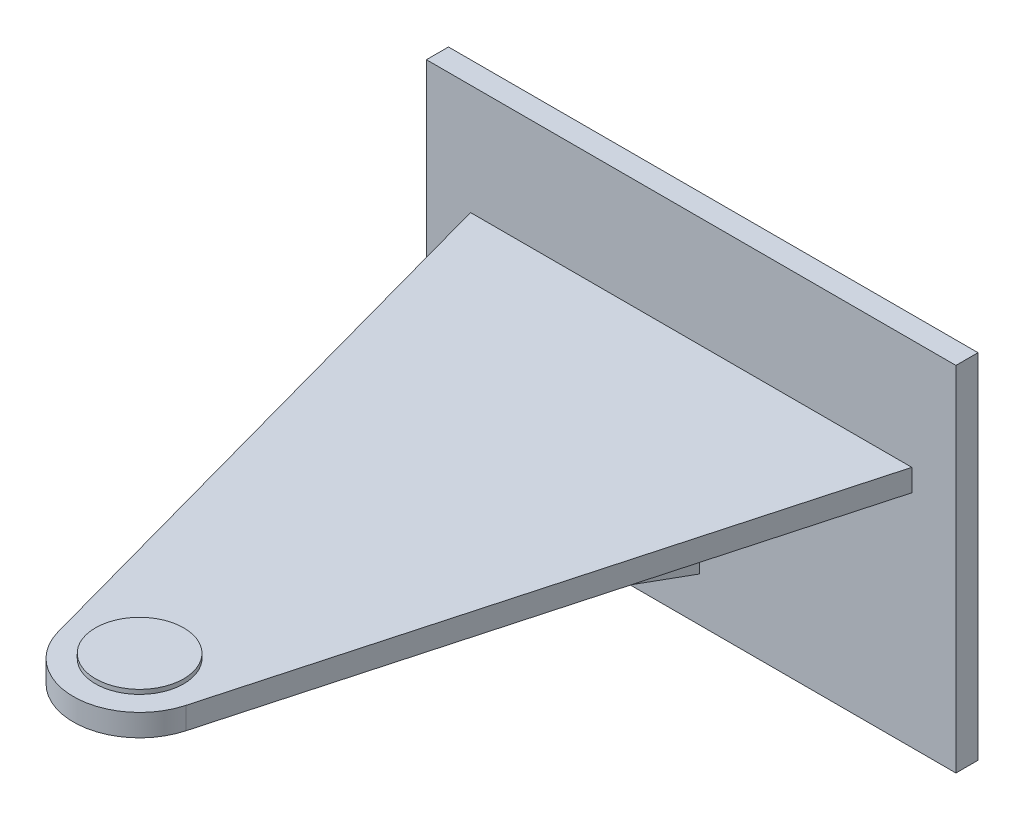
ISO-10303-21;
HEADER;
FILE_DESCRIPTION(('STEP AP214'),'2;1');
FILE_NAME('part.step','',(''),(''),'','','');
FILE_SCHEMA(('AUTOMOTIVE_DESIGN { 1 0 10303 214 1 1 1 1 }'));
ENDSEC;
DATA;
#1=APPLICATION_CONTEXT('core data for automotive mechanical design processes');
#2=APPLICATION_PROTOCOL_DEFINITION('international standard','automotive_design',2000,#1);
#3=PRODUCT_CONTEXT('',#1,'mechanical');
#4=PRODUCT('Part','Part','',(#3));
#5=PRODUCT_RELATED_PRODUCT_CATEGORY('part','',(#4));
#6=PRODUCT_DEFINITION_FORMATION('','',#4);
#7=PRODUCT_DEFINITION_CONTEXT('part definition',#1,'design');
#8=PRODUCT_DEFINITION('design','',#6,#7);
#9=PRODUCT_DEFINITION_SHAPE('','',#8);
#10=(LENGTH_UNIT() NAMED_UNIT(*) SI_UNIT(.MILLI.,.METRE.));
#11=(NAMED_UNIT(*) PLANE_ANGLE_UNIT() SI_UNIT($,.RADIAN.));
#12=(NAMED_UNIT(*) SI_UNIT($,.STERADIAN.) SOLID_ANGLE_UNIT());
#13=UNCERTAINTY_MEASURE_WITH_UNIT(LENGTH_MEASURE(1.E-05),#10,'distance_accuracy_value','');
#14=(GEOMETRIC_REPRESENTATION_CONTEXT(3) GLOBAL_UNCERTAINTY_ASSIGNED_CONTEXT((#13)) GLOBAL_UNIT_ASSIGNED_CONTEXT((#10,
#11,#12)) REPRESENTATION_CONTEXT('',''));
#15=CARTESIAN_POINT('',(0.,0.,0.));
#16=DIRECTION('',(0.,0.,1.));
#17=DIRECTION('',(1.,0.,0.));
#18=AXIS2_PLACEMENT_3D('',#15,#16,#17);
#19=CARTESIAN_POINT('',(-76.2,-50.8,6.35));
#20=DIRECTION('',(0.,0.,1.));
#21=DIRECTION('',(1.,0.,0.));
#22=AXIS2_PLACEMENT_3D('',#19,#20,#21);
#23=PLANE('',#22);
#24=DIRECTION('',(-1.,0.,0.));
#25=VECTOR('',#24,1.);
#26=CARTESIAN_POINT('',(-76.2,50.8,6.35));
#27=LINE('',#26,#25);
#28=CARTESIAN_POINT('',(76.2,50.8,6.35));
#29=VERTEX_POINT('',#28);
#30=CARTESIAN_POINT('',(-76.2,50.8,6.35));
#31=VERTEX_POINT('',#30);
#32=EDGE_CURVE('E220',#29,#31,#27,.T.);
#33=ORIENTED_EDGE('',*,*,#32,.T.);
#34=DIRECTION('',(0.,-1.,0.));
#35=VECTOR('',#34,1.);
#36=CARTESIAN_POINT('',(-76.2,50.8,6.35));
#37=LINE('',#36,#35);
#38=CARTESIAN_POINT('',(-76.2,-50.8,6.35));
#39=VERTEX_POINT('',#38);
#40=EDGE_CURVE('E213',#31,#39,#37,.T.);
#41=ORIENTED_EDGE('',*,*,#40,.T.);
#42=DIRECTION('',(1.,0.,0.));
#43=VECTOR('',#42,1.);
#44=CARTESIAN_POINT('',(-76.2,-50.8,6.35));
#45=LINE('',#44,#43);
#46=CARTESIAN_POINT('',(76.2,-50.8,6.35));
#47=VERTEX_POINT('',#46);
#48=EDGE_CURVE('E216',#39,#47,#45,.T.);
#49=ORIENTED_EDGE('',*,*,#48,.T.);
#50=DIRECTION('',(0.,1.,0.));
#51=VECTOR('',#50,1.);
#52=CARTESIAN_POINT('',(76.2,50.8,6.35));
#53=LINE('',#52,#51);
#54=EDGE_CURVE('E218',#47,#29,#53,.T.);
#55=ORIENTED_EDGE('',*,*,#54,.T.);
#56=EDGE_LOOP('',(#33,#41,#49,#55));
#57=FACE_BOUND('',#56,.T.);
#58=DIRECTION('',(0.,1.,0.));
#59=VECTOR('',#58,1.);
#60=CARTESIAN_POINT('',(-63.5,12.7,6.34999999999999));
#61=LINE('',#60,#59);
#62=CARTESIAN_POINT('',(-63.5,12.7,6.34999999999999));
#63=VERTEX_POINT('',#62);
#64=CARTESIAN_POINT('',(-63.5,19.05,6.34999999999999));
#65=VERTEX_POINT('',#64);
#66=EDGE_CURVE('E194',#63,#65,#61,.T.);
#67=ORIENTED_EDGE('',*,*,#66,.T.);
#68=DIRECTION('',(-1.,0.,0.));
#69=VECTOR('',#68,1.);
#70=CARTESIAN_POINT('',(-63.5,19.05,6.34999999999999));
#71=LINE('',#70,#69);
#72=CARTESIAN_POINT('',(63.5,19.05,6.35));
#73=VERTEX_POINT('',#72);
#74=EDGE_CURVE('E172',#73,#65,#71,.T.);
#75=ORIENTED_EDGE('',*,*,#74,.F.);
#76=DIRECTION('',(0.,1.,0.));
#77=VECTOR('',#76,1.);
#78=CARTESIAN_POINT('',(63.5,12.7,6.34999999999999));
#79=LINE('',#78,#77);
#80=CARTESIAN_POINT('',(63.5,12.7,6.34999999999999));
#81=VERTEX_POINT('',#80);
#82=EDGE_CURVE('E195',#81,#73,#79,.T.);
#83=ORIENTED_EDGE('',*,*,#82,.F.);
#84=DIRECTION('',(-1.,0.,0.));
#85=VECTOR('',#84,1.);
#86=CARTESIAN_POINT('',(-63.5,12.7,6.34999999999999));
#87=LINE('',#86,#85);
#88=CARTESIAN_POINT('',(27.78125,12.7,6.34999999999999));
#89=VERTEX_POINT('',#88);
#90=EDGE_CURVE('E183',#81,#89,#87,.T.);
#91=ORIENTED_EDGE('',*,*,#90,.T.);
#92=DIRECTION('',(0.,1.,0.));
#93=VECTOR('',#92,1.);
#94=CARTESIAN_POINT('',(27.78125,-50.8,6.35));
#95=LINE('',#94,#93);
#96=CARTESIAN_POINT('',(27.78125,-12.7,6.35));
#97=VERTEX_POINT('',#96);
#98=EDGE_CURVE('E145',#97,#89,#95,.T.);
#99=ORIENTED_EDGE('',*,*,#98,.F.);
#100=DIRECTION('',(1.,0.,0.));
#101=VECTOR('',#100,1.);
#102=CARTESIAN_POINT('',(-76.2,-12.7,6.35));
#103=LINE('',#102,#101);
#104=CARTESIAN_POINT('',(23.01875,-12.7,6.35));
#105=VERTEX_POINT('',#104);
#106=EDGE_CURVE('E136',#105,#97,#103,.T.);
#107=ORIENTED_EDGE('',*,*,#106,.F.);
#108=DIRECTION('',(0.,1.,0.));
#109=VECTOR('',#108,1.);
#110=CARTESIAN_POINT('',(23.01875,-50.8,6.35));
#111=LINE('',#110,#109);
#112=CARTESIAN_POINT('',(23.01875,12.7,6.34999999999999));
#113=VERTEX_POINT('',#112);
#114=EDGE_CURVE('E125',#105,#113,#111,.T.);
#115=ORIENTED_EDGE('',*,*,#114,.T.);
#116=CARTESIAN_POINT('',(2.38125,12.7,6.34999999999999));
#117=VERTEX_POINT('',#116);
#118=EDGE_CURVE('E186',#113,#117,#87,.T.);
#119=ORIENTED_EDGE('',*,*,#118,.T.);
#120=DIRECTION('',(0.,1.,0.));
#121=VECTOR('',#120,1.);
#122=CARTESIAN_POINT('',(2.38125,-38.1,6.35));
#123=LINE('',#122,#121);
#124=CARTESIAN_POINT('',(2.38125,-38.1,6.35));
#125=VERTEX_POINT('',#124);
#126=EDGE_CURVE('E49',#125,#117,#123,.T.);
#127=ORIENTED_EDGE('',*,*,#126,.F.);
#128=DIRECTION('',(-1.,0.,0.));
#129=VECTOR('',#128,1.);
#130=CARTESIAN_POINT('',(2.38125,-38.1,6.35));
#131=LINE('',#130,#129);
#132=CARTESIAN_POINT('',(-2.38125,-38.1,6.35));
#133=VERTEX_POINT('',#132);
#134=EDGE_CURVE('E164',#125,#133,#131,.T.);
#135=ORIENTED_EDGE('',*,*,#134,.T.);
#136=DIRECTION('',(0.,1.,0.));
#137=VECTOR('',#136,1.);
#138=CARTESIAN_POINT('',(-2.38125,-38.1,6.35));
#139=LINE('',#138,#137);
#140=CARTESIAN_POINT('',(-2.38125,12.7,6.34999999999999));
#141=VERTEX_POINT('',#140);
#142=EDGE_CURVE('E155',#133,#141,#139,.T.);
#143=ORIENTED_EDGE('',*,*,#142,.T.);
#144=EDGE_CURVE('E182',#141,#63,#87,.T.);
#145=ORIENTED_EDGE('',*,*,#144,.T.);
#146=EDGE_LOOP('',(#67,#75,#83,#91,#99,#107,#115,#119,#127,#135,#143,#145));
#147=FACE_BOUND('',#146,.T.);
#148=ADVANCED_FACE('F26',(#57,#147),#23,.T.);
#149=CARTESIAN_POINT('',(0.,12.7,165.1));
#150=DIRECTION('',(0.,-1.,0.));
#151=DIRECTION('',(0.,0.,-1.));
#152=AXIS2_PLACEMENT_3D('',#149,#150,#151);
#153=PLANE('',#152);
#154=DIRECTION('',(0.,0.,1.));
#155=VECTOR('',#154,1.);
#156=CARTESIAN_POINT('',(27.78125,12.7,165.1));
#157=LINE('',#156,#155);
#158=CARTESIAN_POINT('',(27.78125,12.7,76.2));
#159=VERTEX_POINT('',#158);
#160=EDGE_CURVE('E131',#89,#159,#157,.T.);
#161=ORIENTED_EDGE('',*,*,#160,.F.);
#162=ORIENTED_EDGE('',*,*,#90,.F.);
#163=DIRECTION('',(0.265630018214059,0.,-0.964075045535148));
#164=VECTOR('',#163,1.);
#165=CARTESIAN_POINT('',(63.5,12.7,6.34999999999999));
#166=LINE('',#165,#164);
#167=CARTESIAN_POINT('',(18.3656296174446,12.7,170.160251846978));
#168=VERTEX_POINT('',#167);
#169=EDGE_CURVE('E191',#168,#81,#166,.T.);
#170=ORIENTED_EDGE('',*,*,#169,.F.);
#171=CARTESIAN_POINT('',(0.,12.7,165.1));
#172=DIRECTION('',(0.,1.,0.));
#173=DIRECTION('',(0.,0.,1.));
#174=AXIS2_PLACEMENT_3D('',#171,#172,#173);
#175=CIRCLE('',#174,19.05);
#176=CARTESIAN_POINT('',(-18.3656296174446,12.7,170.160251846978));
#177=VERTEX_POINT('',#176);
#178=EDGE_CURVE('E189',#177,#168,#175,.T.);
#179=ORIENTED_EDGE('',*,*,#178,.F.);
#180=DIRECTION('',(0.265630018214059,0.,0.964075045535148));
#181=VECTOR('',#180,1.);
#182=CARTESIAN_POINT('',(-63.5,12.7,6.34999999999999));
#183=LINE('',#182,#181);
#184=EDGE_CURVE('E185',#63,#177,#183,.T.);
#185=ORIENTED_EDGE('',*,*,#184,.F.);
#186=ORIENTED_EDGE('',*,*,#144,.F.);
#187=DIRECTION('',(0.,0.,1.));
#188=VECTOR('',#187,1.);
#189=CARTESIAN_POINT('',(-2.38125,12.7,6.34999999999999));
#190=LINE('',#189,#188);
#191=CARTESIAN_POINT('',(-2.38125,12.7,146.05));
#192=VERTEX_POINT('',#191);
#193=EDGE_CURVE('E146',#141,#192,#190,.T.);
#194=ORIENTED_EDGE('',*,*,#193,.T.);
#195=DIRECTION('',(-1.,0.,0.));
#196=VECTOR('',#195,1.);
#197=CARTESIAN_POINT('',(2.38125,12.7,146.05));
#198=LINE('',#197,#196);
#199=CARTESIAN_POINT('',(2.38125,12.7,146.05));
#200=VERTEX_POINT('',#199);
#201=EDGE_CURVE('E166',#200,#192,#198,.T.);
#202=ORIENTED_EDGE('',*,*,#201,.F.);
#203=DIRECTION('',(0.,0.,1.));
#204=VECTOR('',#203,1.);
#205=CARTESIAN_POINT('',(2.38125,12.7,6.34999999999999));
#206=LINE('',#205,#204);
#207=EDGE_CURVE('E158',#117,#200,#206,.T.);
#208=ORIENTED_EDGE('',*,*,#207,.F.);
#209=ORIENTED_EDGE('',*,*,#118,.F.);
#210=DIRECTION('',(0.,0.,1.));
#211=VECTOR('',#210,1.);
#212=CARTESIAN_POINT('',(23.01875,12.7,165.1));
#213=LINE('',#212,#211);
#214=CARTESIAN_POINT('',(23.01875,12.7,76.2));
#215=VERTEX_POINT('',#214);
#216=EDGE_CURVE('E128',#113,#215,#213,.T.);
#217=ORIENTED_EDGE('',*,*,#216,.T.);
#218=DIRECTION('',(-1.,0.,0.));
#219=VECTOR('',#218,1.);
#220=CARTESIAN_POINT('',(0.,12.7,76.2));
#221=LINE('',#220,#219);
#222=EDGE_CURVE('E139',#159,#215,#221,.T.);
#223=ORIENTED_EDGE('',*,*,#222,.F.);
#224=EDGE_LOOP('',(#161,#162,#170,#179,#185,#186,#194,#202,#208,#209,#217,#223));
#225=FACE_BOUND('',#224,.T.);
#226=ADVANCED_FACE('F252',(#225),#153,.T.);
#227=CARTESIAN_POINT('',(0.,19.05,165.1));
#228=DIRECTION('',(0.,-1.,0.));
#229=DIRECTION('',(0.,0.,-1.));
#230=AXIS2_PLACEMENT_3D('',#227,#228,#229);
#231=PLANE('',#230);
#232=ORIENTED_EDGE('',*,*,#74,.T.);
#233=DIRECTION('',(0.265630018214059,0.,0.964075045535148));
#234=VECTOR('',#233,1.);
#235=CARTESIAN_POINT('',(-63.5,19.05,6.34999999999999));
#236=LINE('',#235,#234);
#237=CARTESIAN_POINT('',(-18.3656296174446,19.05,170.160251846978));
#238=VERTEX_POINT('',#237);
#239=EDGE_CURVE('E174',#65,#238,#236,.T.);
#240=ORIENTED_EDGE('',*,*,#239,.T.);
#241=CARTESIAN_POINT('',(0.,19.05,165.1));
#242=DIRECTION('',(0.,1.,0.));
#243=DIRECTION('',(0.,0.,-1.));
#244=AXIS2_PLACEMENT_3D('',#241,#242,#243);
#245=CIRCLE('',#244,19.05);
#246=CARTESIAN_POINT('',(18.3656296174446,19.05,170.160251846978));
#247=VERTEX_POINT('',#246);
#248=EDGE_CURVE('E177',#238,#247,#245,.T.);
#249=ORIENTED_EDGE('',*,*,#248,.T.);
#250=DIRECTION('',(0.265630018214059,0.,-0.964075045535148));
#251=VECTOR('',#250,1.);
#252=CARTESIAN_POINT('',(63.5,19.05,6.34999999999999));
#253=LINE('',#252,#251);
#254=EDGE_CURVE('E180',#247,#73,#253,.T.);
#255=ORIENTED_EDGE('',*,*,#254,.T.);
#256=EDGE_LOOP('',(#232,#240,#249,#255));
#257=FACE_BOUND('',#256,.T.);
#258=CARTESIAN_POINT('',(0.,19.05,165.1));
#259=DIRECTION('',(0.,-1.,0.));
#260=DIRECTION('',(0.,0.,-1.));
#261=AXIS2_PLACEMENT_3D('',#258,#259,#260);
#262=CIRCLE('',#261,12.7);
#263=CARTESIAN_POINT('',(0.,19.05,152.4));
#264=VERTEX_POINT('',#263);
#265=EDGE_CURVE('E11',#264,#264,#262,.F.);
#266=ORIENTED_EDGE('',*,*,#265,.F.);
#267=EDGE_LOOP('',(#266));
#268=FACE_BOUND('',#267,.T.);
#269=ADVANCED_FACE('F258',(#257,#268),#231,.F.);
#270=CARTESIAN_POINT('',(-76.2,50.8,6.35));
#271=DIRECTION('',(1.,0.,0.));
#272=DIRECTION('',(0.,1.,0.));
#273=AXIS2_PLACEMENT_3D('',#270,#271,#272);
#274=PLANE('',#273);
#275=DIRECTION('',(0.,-1.,0.));
#276=VECTOR('',#275,1.);
#277=CARTESIAN_POINT('',(-76.2,50.8,0.));
#278=LINE('',#277,#276);
#279=CARTESIAN_POINT('',(-76.2,50.8,0.));
#280=VERTEX_POINT('',#279);
#281=CARTESIAN_POINT('',(-76.2,-50.8,0.));
#282=VERTEX_POINT('',#281);
#283=EDGE_CURVE('E198',#280,#282,#278,.T.);
#284=ORIENTED_EDGE('',*,*,#283,.T.);
#285=DIRECTION('',(0.,0.,-1.));
#286=VECTOR('',#285,1.);
#287=CARTESIAN_POINT('',(-76.2,-50.8,6.35));
#288=LINE('',#287,#286);
#289=EDGE_CURVE('E34',#39,#282,#288,.T.);
#290=ORIENTED_EDGE('',*,*,#289,.F.);
#291=ORIENTED_EDGE('',*,*,#40,.F.);
#292=DIRECTION('',(0.,0.,-1.));
#293=VECTOR('',#292,1.);
#294=CARTESIAN_POINT('',(-76.2,50.8,6.35));
#295=LINE('',#294,#293);
#296=EDGE_CURVE('E222',#31,#280,#295,.T.);
#297=ORIENTED_EDGE('',*,*,#296,.T.);
#298=EDGE_LOOP('',(#284,#290,#291,#297));
#299=FACE_BOUND('',#298,.T.);
#300=ADVANCED_FACE('F28',(#299),#274,.F.);
#301=CARTESIAN_POINT('',(-76.2,-50.8,6.35));
#302=DIRECTION('',(0.,1.,0.));
#303=DIRECTION('',(0.,0.,1.));
#304=AXIS2_PLACEMENT_3D('',#301,#302,#303);
#305=PLANE('',#304);
#306=DIRECTION('',(1.,0.,0.));
#307=VECTOR('',#306,1.);
#308=CARTESIAN_POINT('',(-76.2,-50.8,0.));
#309=LINE('',#308,#307);
#310=CARTESIAN_POINT('',(76.2,-50.8,0.));
#311=VERTEX_POINT('',#310);
#312=EDGE_CURVE('E207',#282,#311,#309,.T.);
#313=ORIENTED_EDGE('',*,*,#312,.T.);
#314=DIRECTION('',(0.,0.,-1.));
#315=VECTOR('',#314,1.);
#316=CARTESIAN_POINT('',(76.2,-50.8,6.35));
#317=LINE('',#316,#315);
#318=EDGE_CURVE('E228',#47,#311,#317,.T.);
#319=ORIENTED_EDGE('',*,*,#318,.F.);
#320=ORIENTED_EDGE('',*,*,#48,.F.);
#321=ORIENTED_EDGE('',*,*,#289,.T.);
#322=EDGE_LOOP('',(#313,#319,#320,#321));
#323=FACE_BOUND('',#322,.T.);
#324=ADVANCED_FACE('F233',(#323),#305,.F.);
#325=CARTESIAN_POINT('',(76.2,50.8,6.35));
#326=DIRECTION('',(-1.,0.,0.));
#327=DIRECTION('',(0.,-1.,0.));
#328=AXIS2_PLACEMENT_3D('',#325,#326,#327);
#329=PLANE('',#328);
#330=DIRECTION('',(0.,1.,0.));
#331=VECTOR('',#330,1.);
#332=CARTESIAN_POINT('',(76.2,50.8,0.));
#333=LINE('',#332,#331);
#334=CARTESIAN_POINT('',(76.2,50.8,0.));
#335=VERTEX_POINT('',#334);
#336=EDGE_CURVE('E209',#311,#335,#333,.T.);
#337=ORIENTED_EDGE('',*,*,#336,.T.);
#338=DIRECTION('',(0.,0.,-1.));
#339=VECTOR('',#338,1.);
#340=CARTESIAN_POINT('',(76.2,50.8,6.35));
#341=LINE('',#340,#339);
#342=EDGE_CURVE('E225',#29,#335,#341,.T.);
#343=ORIENTED_EDGE('',*,*,#342,.F.);
#344=ORIENTED_EDGE('',*,*,#54,.F.);
#345=ORIENTED_EDGE('',*,*,#318,.T.);
#346=EDGE_LOOP('',(#337,#343,#344,#345));
#347=FACE_BOUND('',#346,.T.);
#348=ADVANCED_FACE('F245',(#347),#329,.F.);
#349=CARTESIAN_POINT('',(-76.2,50.8,6.35));
#350=DIRECTION('',(0.,-1.,0.));
#351=DIRECTION('',(0.,0.,-1.));
#352=AXIS2_PLACEMENT_3D('',#349,#350,#351);
#353=PLANE('',#352);
#354=DIRECTION('',(-1.,0.,0.));
#355=VECTOR('',#354,1.);
#356=CARTESIAN_POINT('',(-76.2,50.8,0.));
#357=LINE('',#356,#355);
#358=EDGE_CURVE('E211',#335,#280,#357,.T.);
#359=ORIENTED_EDGE('',*,*,#358,.T.);
#360=ORIENTED_EDGE('',*,*,#296,.F.);
#361=ORIENTED_EDGE('',*,*,#32,.F.);
#362=ORIENTED_EDGE('',*,*,#342,.T.);
#363=EDGE_LOOP('',(#359,#360,#361,#362));
#364=FACE_BOUND('',#363,.T.);
#365=ADVANCED_FACE('F249',(#364),#353,.F.);
#366=CARTESIAN_POINT('',(-76.2,-50.8,0.));
#367=DIRECTION('',(0.,0.,1.));
#368=DIRECTION('',(1.,0.,0.));
#369=AXIS2_PLACEMENT_3D('',#366,#367,#368);
#370=PLANE('',#369);
#371=ORIENTED_EDGE('',*,*,#283,.F.);
#372=ORIENTED_EDGE('',*,*,#358,.F.);
#373=ORIENTED_EDGE('',*,*,#336,.F.);
#374=ORIENTED_EDGE('',*,*,#312,.F.);
#375=EDGE_LOOP('',(#371,#372,#373,#374));
#376=FACE_BOUND('',#375,.T.);
#377=ADVANCED_FACE('F241',(#376),#370,.F.);
#378=CARTESIAN_POINT('',(63.5,12.7,6.34999999999999));
#379=DIRECTION('',(0.964075045535148,0.,0.265630018214059));
#380=DIRECTION('',(0.265630018214059,0.,-0.964075045535148));
#381=AXIS2_PLACEMENT_3D('',#378,#379,#380);
#382=PLANE('',#381);
#383=ORIENTED_EDGE('',*,*,#254,.F.);
#384=DIRECTION('',(0.,1.,0.));
#385=VECTOR('',#384,1.);
#386=CARTESIAN_POINT('',(18.3656296174446,12.7,170.160251846978));
#387=LINE('',#386,#385);
#388=EDGE_CURVE('E199',#168,#247,#387,.T.);
#389=ORIENTED_EDGE('',*,*,#388,.F.);
#390=ORIENTED_EDGE('',*,*,#169,.T.);
#391=ORIENTED_EDGE('',*,*,#82,.T.);
#392=EDGE_LOOP('',(#383,#389,#390,#391));
#393=FACE_BOUND('',#392,.T.);
#394=ADVANCED_FACE('F283',(#393),#382,.T.);
#395=CARTESIAN_POINT('',(0.,12.7,165.1));
#396=DIRECTION('',(0.,1.,0.));
#397=DIRECTION('',(0.,0.,1.));
#398=AXIS2_PLACEMENT_3D('',#395,#396,#397);
#399=CYLINDRICAL_SURFACE('',#398,19.05);
#400=ORIENTED_EDGE('',*,*,#248,.F.);
#401=DIRECTION('',(0.,1.,0.));
#402=VECTOR('',#401,1.);
#403=CARTESIAN_POINT('',(-18.3656296174446,12.7,170.160251846978));
#404=LINE('',#403,#402);
#405=EDGE_CURVE('E201',#177,#238,#404,.T.);
#406=ORIENTED_EDGE('',*,*,#405,.F.);
#407=ORIENTED_EDGE('',*,*,#178,.T.);
#408=ORIENTED_EDGE('',*,*,#388,.T.);
#409=EDGE_LOOP('',(#400,#406,#407,#408));
#410=FACE_BOUND('',#409,.T.);
#411=ADVANCED_FACE('F286',(#410),#399,.T.);
#412=CARTESIAN_POINT('',(-63.5,12.7,6.34999999999999));
#413=DIRECTION('',(-0.964075045535148,0.,0.265630018214059));
#414=DIRECTION('',(0.265630018214059,0.,0.964075045535148));
#415=AXIS2_PLACEMENT_3D('',#412,#413,#414);
#416=PLANE('',#415);
#417=ORIENTED_EDGE('',*,*,#239,.F.);
#418=ORIENTED_EDGE('',*,*,#66,.F.);
#419=ORIENTED_EDGE('',*,*,#184,.T.);
#420=ORIENTED_EDGE('',*,*,#405,.T.);
#421=EDGE_LOOP('',(#417,#418,#419,#420));
#422=FACE_BOUND('',#421,.T.);
#423=ADVANCED_FACE('F289',(#422),#416,.T.);
#424=CARTESIAN_POINT('',(0.,20.32,165.1));
#425=DIRECTION('',(0.,-1.,0.));
#426=DIRECTION('',(0.,0.,-1.));
#427=AXIS2_PLACEMENT_3D('',#424,#425,#426);
#428=CYLINDRICAL_SURFACE('',#427,12.7);
#429=CARTESIAN_POINT('',(0.,20.32,165.1));
#430=DIRECTION('',(0.,1.,0.));
#431=DIRECTION('',(0.,0.,1.));
#432=AXIS2_PLACEMENT_3D('',#429,#430,#431);
#433=CIRCLE('',#432,12.7);
#434=CARTESIAN_POINT('',(0.,20.32,177.8));
#435=VERTEX_POINT('',#434);
#436=EDGE_CURVE('E169',#435,#435,#433,.T.);
#437=ORIENTED_EDGE('',*,*,#436,.F.);
#438=EDGE_LOOP('',(#437));
#439=FACE_BOUND('',#438,.T.);
#440=ORIENTED_EDGE('',*,*,#265,.T.);
#441=EDGE_LOOP('',(#440));
#442=FACE_BOUND('',#441,.T.);
#443=ADVANCED_FACE('F280',(#439,#442),#428,.T.);
#444=CARTESIAN_POINT('',(0.,20.32,165.1));
#445=DIRECTION('',(0.,1.,0.));
#446=DIRECTION('',(0.,0.,1.));
#447=AXIS2_PLACEMENT_3D('',#444,#445,#446);
#448=PLANE('',#447);
#449=ORIENTED_EDGE('',*,*,#436,.T.);
#450=EDGE_LOOP('',(#449));
#451=FACE_BOUND('',#450,.T.);
#452=ADVANCED_FACE('F296',(#451),#448,.T.);
#453=CARTESIAN_POINT('',(2.38125,12.7,146.05));
#454=DIRECTION('',(0.,0.939793423488437,-0.341743063086704));
#455=DIRECTION('',(0.,0.341743063086704,0.939793423488437));
#456=AXIS2_PLACEMENT_3D('',#453,#454,#455);
#457=PLANE('',#456);
#458=DIRECTION('',(0.,-0.341743063086704,-0.939793423488437));
#459=VECTOR('',#458,1.);
#460=CARTESIAN_POINT('',(-2.38125,12.7,146.05));
#461=LINE('',#460,#459);
#462=EDGE_CURVE('E148',#192,#133,#461,.T.);
#463=ORIENTED_EDGE('',*,*,#462,.T.);
#464=ORIENTED_EDGE('',*,*,#134,.F.);
#465=DIRECTION('',(0.,-0.341743063086704,-0.939793423488437));
#466=VECTOR('',#465,1.);
#467=CARTESIAN_POINT('',(2.38125,12.7,146.05));
#468=LINE('',#467,#466);
#469=EDGE_CURVE('E161',#200,#125,#468,.T.);
#470=ORIENTED_EDGE('',*,*,#469,.F.);
#471=ORIENTED_EDGE('',*,*,#201,.T.);
#472=EDGE_LOOP('',(#463,#464,#470,#471));
#473=FACE_BOUND('',#472,.T.);
#474=ADVANCED_FACE('F312',(#473),#457,.F.);
#475=CARTESIAN_POINT('',(2.38125,12.7,6.34999999999999));
#476=DIRECTION('',(-1.,0.,0.));
#477=DIRECTION('',(0.,0.,1.));
#478=AXIS2_PLACEMENT_3D('',#475,#476,#477);
#479=PLANE('',#478);
#480=ORIENTED_EDGE('',*,*,#207,.T.);
#481=ORIENTED_EDGE('',*,*,#469,.T.);
#482=ORIENTED_EDGE('',*,*,#126,.T.);
#483=EDGE_LOOP('',(#480,#481,#482));
#484=FACE_BOUND('',#483,.T.);
#485=ADVANCED_FACE('F309',(#484),#479,.F.);
#486=CARTESIAN_POINT('',(-2.38125,12.7,6.34999999999999));
#487=DIRECTION('',(-1.,0.,0.));
#488=DIRECTION('',(0.,0.,1.));
#489=AXIS2_PLACEMENT_3D('',#486,#487,#488);
#490=PLANE('',#489);
#491=ORIENTED_EDGE('',*,*,#193,.F.);
#492=ORIENTED_EDGE('',*,*,#142,.F.);
#493=ORIENTED_EDGE('',*,*,#462,.F.);
#494=EDGE_LOOP('',(#491,#492,#493));
#495=FACE_BOUND('',#494,.T.);
#496=ADVANCED_FACE('F315',(#495),#490,.T.);
#497=CARTESIAN_POINT('',(25.4,12.7,76.2));
#498=DIRECTION('',(0.,-0.939793423488437,0.341743063086704));
#499=DIRECTION('',(0.,-0.341743063086704,-0.939793423488437));
#500=AXIS2_PLACEMENT_3D('',#497,#498,#499);
#501=PLANE('',#500);
#502=DIRECTION('',(0.,-0.341743063086704,-0.939793423488437));
#503=VECTOR('',#502,1.);
#504=CARTESIAN_POINT('',(23.01875,12.7,76.2));
#505=LINE('',#504,#503);
#506=EDGE_CURVE('E41',#215,#105,#505,.T.);
#507=ORIENTED_EDGE('',*,*,#506,.T.);
#508=ORIENTED_EDGE('',*,*,#106,.T.);
#509=DIRECTION('',(0.,-0.341743063086704,-0.939793423488437));
#510=VECTOR('',#509,1.);
#511=CARTESIAN_POINT('',(27.78125,12.7,76.2));
#512=LINE('',#511,#510);
#513=EDGE_CURVE('E140',#159,#97,#512,.T.);
#514=ORIENTED_EDGE('',*,*,#513,.F.);
#515=ORIENTED_EDGE('',*,*,#222,.T.);
#516=EDGE_LOOP('',(#507,#508,#514,#515));
#517=FACE_BOUND('',#516,.T.);
#518=ADVANCED_FACE('F134',(#517),#501,.T.);
#519=CARTESIAN_POINT('',(27.78125,0.,92.075));
#520=DIRECTION('',(1.,0.,0.));
#521=DIRECTION('',(0.,0.,-1.));
#522=AXIS2_PLACEMENT_3D('',#519,#520,#521);
#523=PLANE('',#522);
#524=ORIENTED_EDGE('',*,*,#513,.T.);
#525=ORIENTED_EDGE('',*,*,#98,.T.);
#526=ORIENTED_EDGE('',*,*,#160,.T.);
#527=EDGE_LOOP('',(#524,#525,#526));
#528=FACE_BOUND('',#527,.T.);
#529=ADVANCED_FACE('F317',(#528),#523,.T.);
#530=CARTESIAN_POINT('',(23.01875,0.,92.075));
#531=DIRECTION('',(1.,0.,0.));
#532=DIRECTION('',(0.,0.,-1.));
#533=AXIS2_PLACEMENT_3D('',#530,#531,#532);
#534=PLANE('',#533);
#535=ORIENTED_EDGE('',*,*,#114,.F.);
#536=ORIENTED_EDGE('',*,*,#506,.F.);
#537=ORIENTED_EDGE('',*,*,#216,.F.);
#538=EDGE_LOOP('',(#535,#536,#537));
#539=FACE_BOUND('',#538,.T.);
#540=ADVANCED_FACE('F126',(#539),#534,.F.);
#541=CLOSED_SHELL('',(#148,#226,#269,#300,#324,#348,#365,#377,#394,#411,#423,#443,#452,#474,
#485,#496,#518,#529,#540));
#542=MANIFOLD_SOLID_BREP('B2',#541);
#543=ADVANCED_BREP_SHAPE_REPRESENTATION('',(#18,#542),#14);
#544=SHAPE_DEFINITION_REPRESENTATION(#9,#543);
ENDSEC;
END-ISO-10303-21;
